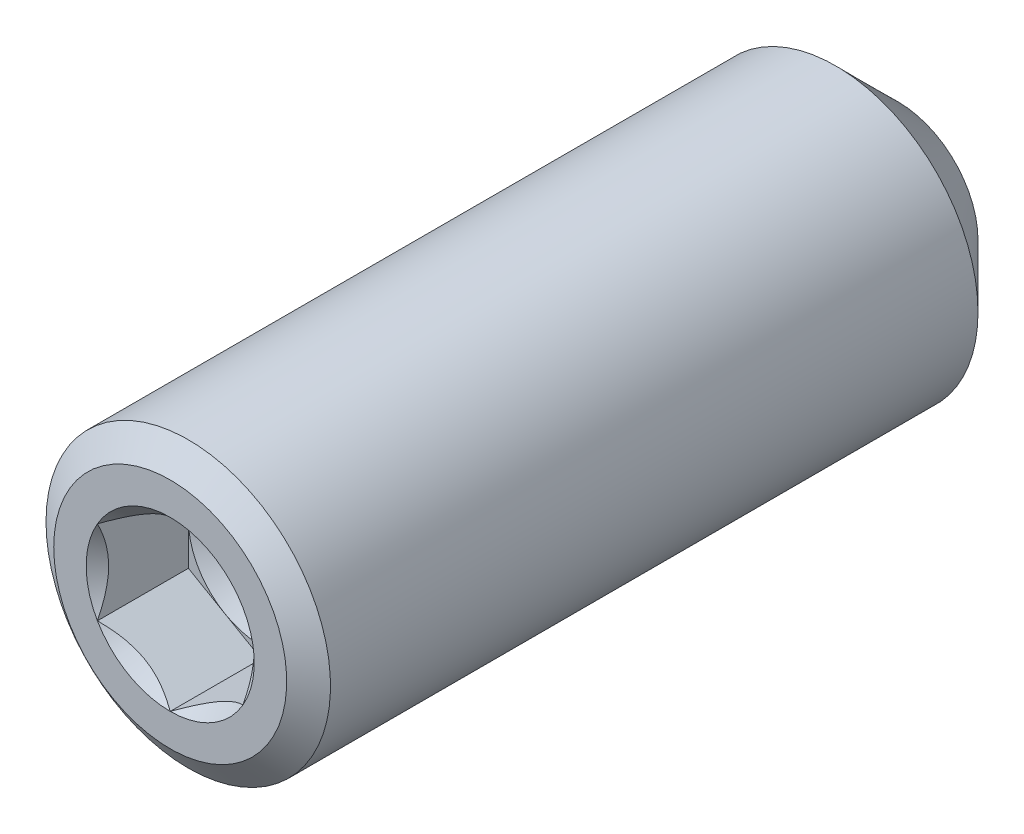
ISO-10303-21;
HEADER;
FILE_DESCRIPTION(('STEP AP214'),'2;1');
FILE_NAME('part.step','',(''),(''),'','','');
FILE_SCHEMA(('AUTOMOTIVE_DESIGN { 1 0 10303 214 1 1 1 1 }'));
ENDSEC;
DATA;
#1=APPLICATION_CONTEXT('core data for automotive mechanical design processes');
#2=APPLICATION_PROTOCOL_DEFINITION('international standard','automotive_design',2000,#1);
#3=PRODUCT_CONTEXT('',#1,'mechanical');
#4=PRODUCT('Part','Part','',(#3));
#5=PRODUCT_RELATED_PRODUCT_CATEGORY('part','',(#4));
#6=PRODUCT_DEFINITION_FORMATION('','',#4);
#7=PRODUCT_DEFINITION_CONTEXT('part definition',#1,'design');
#8=PRODUCT_DEFINITION('design','',#6,#7);
#9=PRODUCT_DEFINITION_SHAPE('','',#8);
#10=(LENGTH_UNIT() NAMED_UNIT(*) SI_UNIT(.MILLI.,.METRE.));
#11=(NAMED_UNIT(*) PLANE_ANGLE_UNIT() SI_UNIT($,.RADIAN.));
#12=(NAMED_UNIT(*) SI_UNIT($,.STERADIAN.) SOLID_ANGLE_UNIT());
#13=UNCERTAINTY_MEASURE_WITH_UNIT(LENGTH_MEASURE(1.E-05),#10,'distance_accuracy_value','');
#14=(GEOMETRIC_REPRESENTATION_CONTEXT(3) GLOBAL_UNCERTAINTY_ASSIGNED_CONTEXT((#13)) GLOBAL_UNIT_ASSIGNED_CONTEXT((#10,
#11,#12)) REPRESENTATION_CONTEXT('',''));
#15=CARTESIAN_POINT('',(0.,0.,0.));
#16=DIRECTION('',(0.,0.,1.));
#17=DIRECTION('',(1.,0.,0.));
#18=AXIS2_PLACEMENT_3D('',#15,#16,#17);
#19=CARTESIAN_POINT('',(0.,0.,-1.26725694678953));
#20=DIRECTION('',(0.,0.,1.));
#21=DIRECTION('',(1.,0.,0.));
#22=AXIS2_PLACEMENT_3D('',#19,#20,#21);
#23=CONICAL_SURFACE('',#22,0.99999999991951,1.04719755099412);
#24=CARTESIAN_POINT('',(0.,0.,-1.26725694672389));
#25=DIRECTION('',(0.,0.,1.));
#26=DIRECTION('',(1.,0.,0.));
#27=AXIS2_PLACEMENT_3D('',#24,#25,#26);
#28=CIRCLE('',#27,1.0000000000332);
#29=CARTESIAN_POINT('',(-0.999999999996476,0.,-1.26725694674409));
#30=VERTEX_POINT('',#29);
#31=CARTESIAN_POINT('',(-0.500000000008299,0.866025403798809,-1.26725694673147));
#32=VERTEX_POINT('',#31);
#33=EDGE_CURVE('E92',#30,#32,#28,.F.);
#34=ORIENTED_EDGE('',*,*,#33,.F.);
#35=CARTESIAN_POINT('',(0.,0.,-1.26725694672389));
#36=DIRECTION('',(0.,0.,1.));
#37=DIRECTION('',(1.,0.,0.));
#38=AXIS2_PLACEMENT_3D('',#35,#36,#37);
#39=CIRCLE('',#38,1.0000000000332);
#40=CARTESIAN_POINT('',(-0.5000000000083,-0.866025403798818,-1.26725694673147));
#41=VERTEX_POINT('',#40);
#42=EDGE_CURVE('E19',#41,#30,#39,.F.);
#43=ORIENTED_EDGE('',*,*,#42,.F.);
#44=CARTESIAN_POINT('',(0.,0.,-1.26725694672389));
#45=DIRECTION('',(0.,0.,1.));
#46=DIRECTION('',(1.,0.,0.));
#47=AXIS2_PLACEMENT_3D('',#44,#45,#46);
#48=CIRCLE('',#47,1.0000000000332);
#49=CARTESIAN_POINT('',(0.500000000008299,-0.866025403798819,-1.26725694673147));
#50=VERTEX_POINT('',#49);
#51=EDGE_CURVE('E89',#50,#41,#48,.F.);
#52=ORIENTED_EDGE('',*,*,#51,.F.);
#53=CARTESIAN_POINT('',(0.,0.,-1.26725694672389));
#54=DIRECTION('',(0.,0.,1.));
#55=DIRECTION('',(1.,0.,0.));
#56=AXIS2_PLACEMENT_3D('',#53,#54,#55);
#57=CIRCLE('',#56,1.0000000000332);
#58=CARTESIAN_POINT('',(1.0000000000166,0.,-1.26725694673147));
#59=VERTEX_POINT('',#58);
#60=EDGE_CURVE('E112',#59,#50,#57,.F.);
#61=ORIENTED_EDGE('',*,*,#60,.F.);
#62=CARTESIAN_POINT('',(0.,0.,-1.26725694672389));
#63=DIRECTION('',(0.,0.,1.));
#64=DIRECTION('',(1.,0.,0.));
#65=AXIS2_PLACEMENT_3D('',#62,#63,#64);
#66=CIRCLE('',#65,1.0000000000332);
#67=CARTESIAN_POINT('',(0.500000000008299,0.866025403798809,-1.26725694673147));
#68=VERTEX_POINT('',#67);
#69=EDGE_CURVE('E346',#68,#59,#66,.F.);
#70=ORIENTED_EDGE('',*,*,#69,.F.);
#71=CARTESIAN_POINT('',(0.,0.,-1.26725694672389));
#72=DIRECTION('',(0.,0.,1.));
#73=DIRECTION('',(1.,0.,0.));
#74=AXIS2_PLACEMENT_3D('',#71,#72,#73);
#75=CIRCLE('',#74,1.0000000000332);
#76=EDGE_CURVE('E350',#32,#68,#75,.F.);
#77=ORIENTED_EDGE('',*,*,#76,.F.);
#78=EDGE_LOOP('',(#34,#43,#52,#61,#70,#77));
#79=FACE_BOUND('',#78,.T.);
#80=CARTESIAN_POINT('',(2.27373675443232E-10,0.,-1.84460721607138));
#81=VERTEX_POINT('',#80);
#82=VERTEX_LOOP('',#81);
#83=FACE_BOUND('',#82,.T.);
#84=ADVANCED_FACE('F16',(#79,#83),#23,.F.);
#85=CARTESIAN_POINT('',(-1.,1.73205080756887,-1.26725694673904));
#86=DIRECTION('',(0.,0.,1.));
#87=DIRECTION('',(1.,0.,0.));
#88=AXIS2_PLACEMENT_3D('',#85,#86,#87);
#89=PLANE('',#88);
#90=DIRECTION('',(0.,-1.,0.));
#91=VECTOR('',#90,1.);
#92=CARTESIAN_POINT('',(-1.,0.577350269189621,-1.26725694673904));
#93=LINE('',#92,#91);
#94=CARTESIAN_POINT('',(-0.99999999999996,-0.577350269189666,-1.26725694673904));
#95=VERTEX_POINT('',#94);
#96=EDGE_CURVE('E99',#30,#95,#93,.T.);
#97=ORIENTED_EDGE('',*,*,#96,.T.);
#98=DIRECTION('',(0.866025403784439,-0.5,0.));
#99=VECTOR('',#98,1.);
#100=CARTESIAN_POINT('',(-1.,-0.577350269189631,-1.26725694673904));
#101=LINE('',#100,#99);
#102=EDGE_CURVE('E97',#95,#41,#101,.T.);
#103=ORIENTED_EDGE('',*,*,#102,.T.);
#104=ORIENTED_EDGE('',*,*,#42,.T.);
#105=EDGE_LOOP('',(#97,#103,#104));
#106=FACE_BOUND('',#105,.T.);
#107=ADVANCED_FACE('F98',(#106),#89,.T.);
#108=CARTESIAN_POINT('',(-1.,1.73205080756887,-1.26725694673904));
#109=DIRECTION('',(0.,0.,1.));
#110=DIRECTION('',(1.,0.,0.));
#111=AXIS2_PLACEMENT_3D('',#108,#109,#110);
#112=PLANE('',#111);
#113=DIRECTION('',(0.866025403784439,-0.5,0.));
#114=VECTOR('',#113,1.);
#115=CARTESIAN_POINT('',(-1.,-0.577350269189631,-1.26725694673904));
#116=LINE('',#115,#114);
#117=CARTESIAN_POINT('',(0.,-1.15470053837924,-1.26725694673904));
#118=VERTEX_POINT('',#117);
#119=EDGE_CURVE('E104',#41,#118,#116,.T.);
#120=ORIENTED_EDGE('',*,*,#119,.T.);
#121=DIRECTION('',(0.866025403784439,0.5,0.));
#122=VECTOR('',#121,1.);
#123=CARTESIAN_POINT('',(0.,-1.15470053837926,-1.26725694673904));
#124=LINE('',#123,#122);
#125=EDGE_CURVE('E110',#118,#50,#124,.T.);
#126=ORIENTED_EDGE('',*,*,#125,.T.);
#127=ORIENTED_EDGE('',*,*,#51,.T.);
#128=EDGE_LOOP('',(#120,#126,#127));
#129=FACE_BOUND('',#128,.T.);
#130=ADVANCED_FACE('F107',(#129),#112,.T.);
#131=CARTESIAN_POINT('',(-1.,1.73205080756887,-1.26725694673904));
#132=DIRECTION('',(0.,0.,1.));
#133=DIRECTION('',(1.,0.,0.));
#134=AXIS2_PLACEMENT_3D('',#131,#132,#133);
#135=PLANE('',#134);
#136=DIRECTION('',(0.866025403784439,0.5,0.));
#137=VECTOR('',#136,1.);
#138=CARTESIAN_POINT('',(0.,-1.15470053837926,-1.26725694673904));
#139=LINE('',#138,#137);
#140=CARTESIAN_POINT('',(1.00000000000001,-0.577350269189578,-1.26725694673904));
#141=VERTEX_POINT('',#140);
#142=EDGE_CURVE('E126',#50,#141,#139,.T.);
#143=ORIENTED_EDGE('',*,*,#142,.T.);
#144=DIRECTION('',(0.,1.,0.));
#145=VECTOR('',#144,1.);
#146=CARTESIAN_POINT('',(1.,-0.577350269189631,-1.26725694673904));
#147=LINE('',#146,#145);
#148=EDGE_CURVE('E310',#141,#59,#147,.T.);
#149=ORIENTED_EDGE('',*,*,#148,.T.);
#150=ORIENTED_EDGE('',*,*,#60,.T.);
#151=EDGE_LOOP('',(#143,#149,#150));
#152=FACE_BOUND('',#151,.T.);
#153=ADVANCED_FACE('F341',(#152),#135,.T.);
#154=CARTESIAN_POINT('',(-1.,1.73205080756887,-1.26725694673904));
#155=DIRECTION('',(0.,0.,1.));
#156=DIRECTION('',(1.,0.,0.));
#157=AXIS2_PLACEMENT_3D('',#154,#155,#156);
#158=PLANE('',#157);
#159=DIRECTION('',(0.,1.,0.));
#160=VECTOR('',#159,1.);
#161=CARTESIAN_POINT('',(1.,-0.577350269189631,-1.26725694673904));
#162=LINE('',#161,#160);
#163=CARTESIAN_POINT('',(0.999999999999972,0.577350269189646,-1.26725694673904));
#164=VERTEX_POINT('',#163);
#165=EDGE_CURVE('E306',#59,#164,#162,.T.);
#166=ORIENTED_EDGE('',*,*,#165,.T.);
#167=DIRECTION('',(-0.866025403784439,0.5,0.));
#168=VECTOR('',#167,1.);
#169=CARTESIAN_POINT('',(1.,0.577350269189621,-1.26725694673904));
#170=LINE('',#169,#168);
#171=EDGE_CURVE('E305',#164,#68,#170,.T.);
#172=ORIENTED_EDGE('',*,*,#171,.T.);
#173=ORIENTED_EDGE('',*,*,#69,.T.);
#174=EDGE_LOOP('',(#166,#172,#173));
#175=FACE_BOUND('',#174,.T.);
#176=ADVANCED_FACE('F347',(#175),#158,.T.);
#177=CARTESIAN_POINT('',(-1.,1.73205080756887,-1.26725694673904));
#178=DIRECTION('',(0.,0.,1.));
#179=DIRECTION('',(1.,0.,0.));
#180=AXIS2_PLACEMENT_3D('',#177,#178,#179);
#181=PLANE('',#180);
#182=DIRECTION('',(-0.866025403784439,0.5,0.));
#183=VECTOR('',#182,1.);
#184=CARTESIAN_POINT('',(1.,0.577350269189621,-1.26725694673904));
#185=LINE('',#184,#183);
#186=CARTESIAN_POINT('',(0.,1.15470053837925,-1.26725694673904));
#187=VERTEX_POINT('',#186);
#188=EDGE_CURVE('E299',#68,#187,#185,.T.);
#189=ORIENTED_EDGE('',*,*,#188,.T.);
#190=DIRECTION('',(-0.866025403784439,-0.5,0.));
#191=VECTOR('',#190,1.);
#192=CARTESIAN_POINT('',(0.,1.15470053837925,-1.26725694673904));
#193=LINE('',#192,#191);
#194=EDGE_CURVE('E298',#187,#32,#193,.T.);
#195=ORIENTED_EDGE('',*,*,#194,.T.);
#196=ORIENTED_EDGE('',*,*,#76,.T.);
#197=EDGE_LOOP('',(#189,#195,#196));
#198=FACE_BOUND('',#197,.T.);
#199=ADVANCED_FACE('F359',(#198),#181,.T.);
#200=CARTESIAN_POINT('',(-1.,1.73205080756887,-1.26725694673904));
#201=DIRECTION('',(0.,0.,1.));
#202=DIRECTION('',(1.,0.,0.));
#203=AXIS2_PLACEMENT_3D('',#200,#201,#202);
#204=PLANE('',#203);
#205=DIRECTION('',(-0.866025403784439,-0.5,0.));
#206=VECTOR('',#205,1.);
#207=CARTESIAN_POINT('',(0.,1.15470053837925,-1.26725694673904));
#208=LINE('',#207,#206);
#209=CARTESIAN_POINT('',(-1.,0.577350269189622,-1.26725694673904));
#210=VERTEX_POINT('',#209);
#211=EDGE_CURVE('E292',#32,#210,#208,.T.);
#212=ORIENTED_EDGE('',*,*,#211,.T.);
#213=DIRECTION('',(0.,-1.,0.));
#214=VECTOR('',#213,1.);
#215=CARTESIAN_POINT('',(-1.,0.577350269189621,-1.26725694673904));
#216=LINE('',#215,#214);
#217=EDGE_CURVE('E130',#210,#30,#216,.T.);
#218=ORIENTED_EDGE('',*,*,#217,.T.);
#219=ORIENTED_EDGE('',*,*,#33,.T.);
#220=EDGE_LOOP('',(#212,#218,#219));
#221=FACE_BOUND('',#220,.T.);
#222=ADVANCED_FACE('F364',(#221),#204,.T.);
#223=CARTESIAN_POINT('',(-1.,0.577350269189621,-1.26725694673904));
#224=DIRECTION('',(-1.,0.,0.));
#225=DIRECTION('',(0.,-1.,0.));
#226=AXIS2_PLACEMENT_3D('',#223,#224,#225);
#227=PLANE('',#226);
#228=CARTESIAN_POINT('',(-0.999999999995421,0.577350269201763,-0.0172569467675729));
#229=CARTESIAN_POINT('',(-0.999999999998353,0.53766259330573,-0.0370816470854354));
#230=CARTESIAN_POINT('',(-0.999999999999558,0.497311421197551,-0.0557419131490855));
#231=CARTESIAN_POINT('',(-1.00000000000045,0.41503123975332,-0.089908069903511));
#232=CARTESIAN_POINT('',(-1.00000000000012,0.373094409840016,-0.105394956807298));
#233=CARTESIAN_POINT('',(-0.999999999999884,0.288530684286817,-0.131923906455443));
#234=CARTESIAN_POINT('',(-0.99999999999997,0.2459253154492,-0.143032634244833));
#235=CARTESIAN_POINT('',(-1.00000000000003,0.159777529607276,-0.160148459916529));
#236=CARTESIAN_POINT('',(-1.00000000000001,0.116237740789767,-0.166168326994063));
#237=CARTESIAN_POINT('',(-0.999999999999995,0.041190805636566,-0.171598062088634));
#238=CARTESIAN_POINT('',(-0.999999999999999,0.00978111645860827,-0.172400379920507));
#239=CARTESIAN_POINT('',(-1.,-0.0529773241572559,-0.171048167113774));
#240=CARTESIAN_POINT('',(-1.,-0.0843260606025248,-0.168892983315698));
#241=CARTESIAN_POINT('',(-1.,-0.177924373817535,-0.15813362719194));
#242=CARTESIAN_POINT('',(-1.,-0.239708022653016,-0.145234438698292));
#243=CARTESIAN_POINT('',(-1.,-0.34809918718393,-0.114119266303241));
#244=CARTESIAN_POINT('',(-1.,-0.395216894793119,-0.0975399591567761));
#245=CARTESIAN_POINT('',(-1.,-0.487608327503127,-0.0601956618666922));
#246=CARTESIAN_POINT('',(-1.,-0.532887492946774,-0.0394442971598875));
#247=CARTESIAN_POINT('',(-1.,-0.577350269202541,-0.0172569467697208));
#248=B_SPLINE_CURVE_WITH_KNOTS('',3,(#228,#229,#230,#231,#232,#233,#234,#235,#236,#237,#238,
#239,#240,#241,#242,#243,#244,#245,#246,#247),.UNSPECIFIED.,.F.,.F.,(4,2,2,2,2,2,2,2,2,4),(0.,
0.133182946550927,0.267141541406727,0.398973326726491,0.530473323585895,0.624596460286415,
0.718740387275724,0.90708160029007,1.05673041318259,1.20589820630046),.UNSPECIFIED.);
#249=CARTESIAN_POINT('',(-1.00000000000574,0.577350269192881,-0.0172569467695536));
#250=VERTEX_POINT('',#249);
#251=CARTESIAN_POINT('',(-1.00000000001206,-0.577350269189309,-0.0172569467658887));
#252=VERTEX_POINT('',#251);
#253=EDGE_CURVE('E234',#250,#252,#248,.T.);
#254=ORIENTED_EDGE('',*,*,#253,.T.);
#255=DIRECTION('',(0.,0.,1.));
#256=VECTOR('',#255,1.);
#257=CARTESIAN_POINT('',(-0.99999999999994,-0.577350269189666,-1.26725694673904));
#258=LINE('',#257,#256);
#259=EDGE_CURVE('E116',#252,#95,#258,.F.);
#260=ORIENTED_EDGE('',*,*,#259,.T.);
#261=ORIENTED_EDGE('',*,*,#96,.F.);
#262=ORIENTED_EDGE('',*,*,#217,.F.);
#263=DIRECTION('',(0.,0.,1.));
#264=VECTOR('',#263,1.);
#265=CARTESIAN_POINT('',(-1.,0.577350269189621,-1.26725694673904));
#266=LINE('',#265,#264);
#267=EDGE_CURVE('E288',#210,#250,#266,.T.);
#268=ORIENTED_EDGE('',*,*,#267,.T.);
#269=EDGE_LOOP('',(#254,#260,#261,#262,#268));
#270=FACE_BOUND('',#269,.T.);
#271=ADVANCED_FACE('F225',(#270),#227,.F.);
#272=CARTESIAN_POINT('',(-1.,-0.577350269189631,-1.26725694673904));
#273=DIRECTION('',(-0.5,-0.866025403784439,0.));
#274=DIRECTION('',(0.866025403784439,-0.5,0.));
#275=AXIS2_PLACEMENT_3D('',#272,#273,#274);
#276=PLANE('',#275);
#277=CARTESIAN_POINT('',(-1.00000000000822,-0.577350269179602,-0.0172569467676005));
#278=CARTESIAN_POINT('',(-0.965629464466558,-0.597194107130155,-0.0370816470854609));
#279=CARTESIAN_POINT('',(-0.930684324349,-0.617369693185287,-0.0557419131491097));
#280=CARTESIAN_POINT('',(-0.859427596990747,-0.658509783908169,-0.0899080699035332));
#281=CARTESIAN_POINT('',(-0.823109236931477,-0.679478198864538,-0.10539495680732));
#282=CARTESIAN_POINT('',(-0.749874902363636,-0.721760061640934,-0.131923906455464));
#283=CARTESIAN_POINT('',(-0.712977570612697,-0.743062746059815,-0.143032634244853));
#284=CARTESIAN_POINT('',(-0.638371399593842,-0.78613663898083,-0.160148459916548));
#285=CARTESIAN_POINT('',(-0.600664836402459,-0.807906533389563,-0.166168326994081));
#286=CARTESIAN_POINT('',(-0.535672284083619,-0.845430000966153,-0.171598062088652));
#287=CARTESIAN_POINT('',(-0.508470695330536,-0.861134845555134,-0.172400379920525));
#288=CARTESIAN_POINT('',(-0.454120291455303,-0.892514065863068,-0.171048167113792));
#289=CARTESIAN_POINT('',(-0.426971489317157,-0.908188434085702,-0.168892983315715));
#290=CARTESIAN_POINT('',(-0.345912972321585,-0.954987590693205,-0.158133627191956));
#291=CARTESIAN_POINT('',(-0.292406762891563,-0.985879415110946,-0.145234438698309));
#292=CARTESIAN_POINT('',(-0.198537260862009,-1.04007499737641,-0.114119266303255));
#293=CARTESIAN_POINT('',(-0.15773212910436,-1.063633851181,-0.0975399591567885));
#294=CARTESIAN_POINT('',(-0.0777188012854456,-1.10982956753601,-0.0601956618666998));
#295=CARTESIAN_POINT('',(-0.0385058937490852,-1.13246915025784,-0.0394442971598923));
#296=CARTESIAN_POINT('',(1.11958770631531E-11,-1.15470053838572,-0.0172569467697223));
#297=B_SPLINE_CURVE_WITH_KNOTS('',3,(#277,#278,#279,#280,#281,#282,#283,#284,#285,#286,#287,
#288,#289,#290,#291,#292,#293,#294,#295,#296),.UNSPECIFIED.,.F.,.F.,(4,2,2,2,2,2,2,2,2,4),(0.,
0.133182946550923,0.26714154140672,0.398973326726481,0.530473323585881,0.624596460286401,
0.718740387275708,0.907081600290052,1.05673041318258,1.20589820630047),.UNSPECIFIED.);
#298=CARTESIAN_POINT('',(-6.31169427938226E-12,-1.15470053838955,-0.0172569467658894));
#299=VERTEX_POINT('',#298);
#300=EDGE_CURVE('E228',#252,#299,#297,.T.);
#301=ORIENTED_EDGE('',*,*,#300,.T.);
#302=DIRECTION('',(0.,0.,1.));
#303=VECTOR('',#302,1.);
#304=CARTESIAN_POINT('',(0.,-1.15470053837922,-1.26725694673904));
#305=LINE('',#304,#303);
#306=EDGE_CURVE('E115',#299,#118,#305,.F.);
#307=ORIENTED_EDGE('',*,*,#306,.T.);
#308=ORIENTED_EDGE('',*,*,#119,.F.);
#309=ORIENTED_EDGE('',*,*,#102,.F.);
#310=ORIENTED_EDGE('',*,*,#259,.F.);
#311=EDGE_LOOP('',(#301,#307,#308,#309,#310));
#312=FACE_BOUND('',#311,.T.);
#313=ADVANCED_FACE('F113',(#312),#276,.F.);
#314=CARTESIAN_POINT('',(0.,-1.15470053837926,-1.26725694673904));
#315=DIRECTION('',(0.5,-0.866025403784439,0.));
#316=DIRECTION('',(0.866025403784439,0.5,0.));
#317=AXIS2_PLACEMENT_3D('',#314,#315,#316);
#318=PLANE('',#317);
#319=CARTESIAN_POINT('',(-1.27907551351768E-11,-1.15470053838137,-0.0172569467676159));
#320=CARTESIAN_POINT('',(0.0343705355317997,-1.13485670043588,-0.0370816470854732));
#321=CARTESIAN_POINT('',(0.0693156756505605,-1.11468111438284,-0.05574191314912));
#322=CARTESIAN_POINT('',(0.140572403009697,-1.07354102366149,-0.0899080699035407));
#323=CARTESIAN_POINT('',(0.176890763068639,-1.05257260870456,-0.105394956807327));
#324=CARTESIAN_POINT('',(0.250125097636244,-1.01029074592776,-0.131923906455468));
#325=CARTESIAN_POINT('',(0.287022429387266,-0.988988061509023,-0.143032634244856));
#326=CARTESIAN_POINT('',(0.36162860040618,-0.945914168588117,-0.160148459916549));
#327=CARTESIAN_POINT('',(0.399335163597539,-0.924144274179343,-0.166168326994082));
#328=CARTESIAN_POINT('',(0.464327715916365,-0.886620806602734,-0.171598062088652));
#329=CARTESIAN_POINT('',(0.491529304669451,-0.870915962013758,-0.172400379920525));
#330=CARTESIAN_POINT('',(0.545879708544687,-0.839536741705829,-0.171048167113791));
#331=CARTESIAN_POINT('',(0.573028510682833,-0.823862373483194,-0.168892983315715));
#332=CARTESIAN_POINT('',(0.654087027678403,-0.777063216875688,-0.158133627191955));
#333=CARTESIAN_POINT('',(0.707593237108426,-0.746171392457949,-0.145234438698307));
#334=CARTESIAN_POINT('',(0.801462739137979,-0.691975810192491,-0.114119266303253));
#335=CARTESIAN_POINT('',(0.842267870895627,-0.668416956387894,-0.097539959156786));
#336=CARTESIAN_POINT('',(0.922281198714541,-0.622221240032886,-0.0601956618666972));
#337=CARTESIAN_POINT('',(0.961494106250901,-0.599581657311061,-0.0394442971598899));
#338=CARTESIAN_POINT('',(1.00000000001118,-0.577350269183176,-0.0172569467697204));
#339=B_SPLINE_CURVE_WITH_KNOTS('',3,(#319,#320,#321,#322,#323,#324,#325,#326,#327,#328,#329,
#330,#331,#332,#333,#334,#335,#336,#337,#338),.UNSPECIFIED.,.F.,.F.,(4,2,2,2,2,2,2,2,2,4),(0.,
0.133182946550918,0.26714154140671,0.398973326726465,0.53047332358586,0.62459646028638,
0.718740387275687,0.907081600290032,1.05673041318256,1.20589820630044),.UNSPECIFIED.);
#340=CARTESIAN_POINT('',(1.00000000000575,-0.57735026920024,-0.0172569467658884));
#341=VERTEX_POINT('',#340);
#342=EDGE_CURVE('E204',#299,#341,#339,.T.);
#343=ORIENTED_EDGE('',*,*,#342,.T.);
#344=DIRECTION('',(0.,0.,-1.));
#345=VECTOR('',#344,1.);
#346=CARTESIAN_POINT('',(1.,-0.57735026918956,-1.26725694673904));
#347=LINE('',#346,#345);
#348=EDGE_CURVE('E302',#341,#141,#347,.T.);
#349=ORIENTED_EDGE('',*,*,#348,.T.);
#350=ORIENTED_EDGE('',*,*,#142,.F.);
#351=ORIENTED_EDGE('',*,*,#125,.F.);
#352=ORIENTED_EDGE('',*,*,#306,.F.);
#353=EDGE_LOOP('',(#343,#349,#350,#351,#352));
#354=FACE_BOUND('',#353,.T.);
#355=ADVANCED_FACE('F215',(#354),#318,.F.);
#356=CARTESIAN_POINT('',(1.,-0.577350269189631,-1.26725694673904));
#357=DIRECTION('',(1.,0.,0.));
#358=DIRECTION('',(0.,0.,-1.));
#359=AXIS2_PLACEMENT_3D('',#356,#357,#358);
#360=PLANE('',#359);
#361=CARTESIAN_POINT('',(0.999999999995426,-0.577350269201765,-0.0172569467676012));
#362=CARTESIAN_POINT('',(0.999999999998354,-0.537662593305733,-0.0370816470854594));
#363=CARTESIAN_POINT('',(0.999999999999559,-0.497311421197557,-0.0557419131491062));
#364=CARTESIAN_POINT('',(1.00000000000044,-0.415031239753332,-0.089908069903526));
#365=CARTESIAN_POINT('',(1.00000000000012,-0.373094409840032,-0.105394956807311));
#366=CARTESIAN_POINT('',(0.999999999999884,-0.28853068428684,-0.131923906455452));
#367=CARTESIAN_POINT('',(0.99999999999997,-0.245925315449226,-0.143032634244839));
#368=CARTESIAN_POINT('',(1.00000000000003,-0.15977752960731,-0.160148459916532));
#369=CARTESIAN_POINT('',(1.00000000000001,-0.116237740789804,-0.166168326994064));
#370=CARTESIAN_POINT('',(0.999999999999995,-0.041190805636607,-0.171598062088634));
#371=CARTESIAN_POINT('',(0.999999999999999,-0.00978111645864932,-0.172400379920508));
#372=CARTESIAN_POINT('',(1.,0.0529773241572145,-0.171048167113774));
#373=CARTESIAN_POINT('',(1.,0.0843260606024832,-0.168892983315697));
#374=CARTESIAN_POINT('',(1.,0.177924373817493,-0.158133627191938));
#375=CARTESIAN_POINT('',(1.,0.239708022652974,-0.14523443869829));
#376=CARTESIAN_POINT('',(1.,0.348099187183887,-0.114119266303238));
#377=CARTESIAN_POINT('',(1.,0.395216894793075,-0.0975399591567731));
#378=CARTESIAN_POINT('',(1.,0.487608327503082,-0.0601956618666891));
#379=CARTESIAN_POINT('',(1.,0.532887492946728,-0.0394442971598843));
#380=CARTESIAN_POINT('',(1.,0.577350269202495,-0.0172569467697173));
#381=B_SPLINE_CURVE_WITH_KNOTS('',3,(#361,#362,#363,#364,#365,#366,#367,#368,#369,#370,#371,
#372,#373,#374,#375,#376,#377,#378,#379,#380),.UNSPECIFIED.,.F.,.F.,(4,2,2,2,2,2,2,2,2,4),(0.,
0.133182946550915,0.267141541406703,0.398973326726456,0.530473323585848,0.624596460286368,
0.718740387275676,0.907081600290022,1.05673041318254,1.20589820630041),.UNSPECIFIED.);
#382=CARTESIAN_POINT('',(1.00000000001205,0.577350269189292,-0.0172569467658871));
#383=VERTEX_POINT('',#382);
#384=EDGE_CURVE('E197',#341,#383,#381,.T.);
#385=ORIENTED_EDGE('',*,*,#384,.T.);
#386=DIRECTION('',(0.,0.,1.));
#387=VECTOR('',#386,1.);
#388=CARTESIAN_POINT('',(0.999999999999957,0.577350269189646,-1.26725694673904));
#389=LINE('',#388,#387);
#390=EDGE_CURVE('E295',#383,#164,#389,.F.);
#391=ORIENTED_EDGE('',*,*,#390,.T.);
#392=ORIENTED_EDGE('',*,*,#165,.F.);
#393=ORIENTED_EDGE('',*,*,#148,.F.);
#394=ORIENTED_EDGE('',*,*,#348,.F.);
#395=EDGE_LOOP('',(#385,#391,#392,#393,#394));
#396=FACE_BOUND('',#395,.T.);
#397=ADVANCED_FACE('F211',(#396),#360,.F.);
#398=CARTESIAN_POINT('',(1.,0.577350269189621,-1.26725694673904));
#399=DIRECTION('',(0.5,0.866025403784439,0.));
#400=DIRECTION('',(-0.866025403784439,0.5,0.));
#401=AXIS2_PLACEMENT_3D('',#398,#399,#400);
#402=PLANE('',#401);
#403=CARTESIAN_POINT('',(1.00000000000822,0.57735026917958,-0.0172569467675707));
#404=CARTESIAN_POINT('',(0.965629464466563,0.597194107130138,-0.0370816470854328));
#405=CARTESIAN_POINT('',(0.930684324349007,0.617369693185271,-0.0557419131490814));
#406=CARTESIAN_POINT('',(0.859427596990758,0.658509783908154,-0.0899080699035033));
#407=CARTESIAN_POINT('',(0.823109236931489,0.679478198864521,-0.105394956807288));
#408=CARTESIAN_POINT('',(0.74987490236365,0.721760061640915,-0.13192390645543));
#409=CARTESIAN_POINT('',(0.712977570612713,0.743062746059796,-0.143032634244818));
#410=CARTESIAN_POINT('',(0.63837139959386,0.786136638980809,-0.160148459916511));
#411=CARTESIAN_POINT('',(0.600664836402478,0.807906533389542,-0.166168326994044));
#412=CARTESIAN_POINT('',(0.535672284083638,0.845430000966131,-0.171598062088615));
#413=CARTESIAN_POINT('',(0.508470695330555,0.861134845555113,-0.172400379920488));
#414=CARTESIAN_POINT('',(0.45412029145532,0.892514065863048,-0.171048167113755));
#415=CARTESIAN_POINT('',(0.426971489317173,0.908188434085682,-0.168892983315678));
#416=CARTESIAN_POINT('',(0.345912972321599,0.954987590693187,-0.158133627191919));
#417=CARTESIAN_POINT('',(0.292406762891575,0.985879415110929,-0.145234438698271));
#418=CARTESIAN_POINT('',(0.198537260862037,1.04007499737638,-0.114119266303223));
#419=CARTESIAN_POINT('',(0.157732129104403,1.06363385118097,-0.0975399591567643));
#420=CARTESIAN_POINT('',(0.0777188012855182,1.10982956753596,-0.0601956618666939));
#421=CARTESIAN_POINT('',(0.0385058937491723,1.13246915025777,-0.039444297159897));
#422=CARTESIAN_POINT('',(-1.10948717346902E-11,1.15470053838565,-0.0172569467697383));
#423=B_SPLINE_CURVE_WITH_KNOTS('',3,(#403,#404,#405,#406,#407,#408,#409,#410,#411,#412,#413,
#414,#415,#416,#417,#418,#419,#420,#421,#422),.UNSPECIFIED.,.F.,.F.,(4,2,2,2,2,2,2,2,2,4),(0.,
0.133182946550918,0.26714154140671,0.398973326726466,0.530473323585862,0.624596460286384,
0.718740387275694,0.907081600290043,1.05673041318252,1.20589820630034),.UNSPECIFIED.);
#424=CARTESIAN_POINT('',(6.32595022348094E-12,1.15470053838949,-0.0172569467658978));
#425=VERTEX_POINT('',#424);
#426=EDGE_CURVE('E166',#383,#425,#423,.T.);
#427=ORIENTED_EDGE('',*,*,#426,.T.);
#428=DIRECTION('',(0.,0.,1.));
#429=VECTOR('',#428,1.);
#430=CARTESIAN_POINT('',(0.,1.15470053837925,-1.26725694673904));
#431=LINE('',#430,#429);
#432=EDGE_CURVE('E285',#425,#187,#431,.F.);
#433=ORIENTED_EDGE('',*,*,#432,.T.);
#434=ORIENTED_EDGE('',*,*,#188,.F.);
#435=ORIENTED_EDGE('',*,*,#171,.F.);
#436=ORIENTED_EDGE('',*,*,#390,.F.);
#437=EDGE_LOOP('',(#427,#433,#434,#435,#436));
#438=FACE_BOUND('',#437,.T.);
#439=ADVANCED_FACE('F214',(#438),#402,.F.);
#440=CARTESIAN_POINT('',(0.,1.15470053837925,-1.26725694673904));
#441=DIRECTION('',(-0.5,0.866025403784439,0.));
#442=DIRECTION('',(-0.866025403784439,-0.5,0.));
#443=AXIS2_PLACEMENT_3D('',#440,#441,#442);
#444=PLANE('',#443);
#445=CARTESIAN_POINT('',(1.28513580720746E-11,1.15470053838134,-0.0172569467675267));
#446=CARTESIAN_POINT('',(-0.0343705355317509,1.13485670043588,-0.0370816470853999));
#447=CARTESIAN_POINT('',(-0.0693156756505183,1.11468111438285,-0.0557419131490549));
#448=CARTESIAN_POINT('',(-0.140572403009663,1.0735410236615,-0.0899080699034851));
#449=CARTESIAN_POINT('',(-0.176890763068607,1.05257260870457,-0.105394956807272));
#450=CARTESIAN_POINT('',(-0.250125097636216,1.01029074592776,-0.131923906455418));
#451=CARTESIAN_POINT('',(-0.287022429387242,0.988988061509027,-0.143032634244808));
#452=CARTESIAN_POINT('',(-0.361628600406162,0.945914168588118,-0.160148459916506));
#453=CARTESIAN_POINT('',(-0.399335163597523,0.924144274179342,-0.166168326994041));
#454=CARTESIAN_POINT('',(-0.464327715916353,0.886620806602731,-0.171598062088613));
#455=CARTESIAN_POINT('',(-0.49152930466944,0.870915962013755,-0.172400379920488));
#456=CARTESIAN_POINT('',(-0.545879708544678,0.839536741705825,-0.171048167113756));
#457=CARTESIAN_POINT('',(-0.573028510682824,0.823862373483189,-0.16889298331568));
#458=CARTESIAN_POINT('',(-0.654087027678396,0.777063216875682,-0.158133627191924));
#459=CARTESIAN_POINT('',(-0.707593237108421,0.746171392457942,-0.145234438698277));
#460=CARTESIAN_POINT('',(-0.801462739137971,0.691975810192485,-0.114119266303228));
#461=CARTESIAN_POINT('',(-0.842267870895615,0.668416956387891,-0.0975399591567644));
#462=CARTESIAN_POINT('',(-0.922281198714521,0.622221240032888,-0.0601956618666833));
#463=CARTESIAN_POINT('',(-0.961494106250877,0.599581657311065,-0.0394442971598801));
#464=CARTESIAN_POINT('',(-1.00000000001115,0.577350269183182,-0.0172569467697145));
#465=B_SPLINE_CURVE_WITH_KNOTS('',3,(#445,#446,#447,#448,#449,#450,#451,#452,#453,#454,#455,
#456,#457,#458,#459,#460,#461,#462,#463,#464),.UNSPECIFIED.,.F.,.F.,(4,2,2,2,2,2,2,2,2,4),(0.,
0.13318294655093,0.267141541406734,0.3989733267265,0.530473323585906,0.624596460286428,
0.718740387275738,0.907081600290087,1.0567304131826,1.20589820630047),.UNSPECIFIED.);
#466=EDGE_CURVE('E157',#425,#250,#465,.T.);
#467=ORIENTED_EDGE('',*,*,#466,.T.);
#468=ORIENTED_EDGE('',*,*,#267,.F.);
#469=ORIENTED_EDGE('',*,*,#211,.F.);
#470=ORIENTED_EDGE('',*,*,#194,.F.);
#471=ORIENTED_EDGE('',*,*,#432,.F.);
#472=EDGE_LOOP('',(#467,#468,#469,#470,#471));
#473=FACE_BOUND('',#472,.T.);
#474=ADVANCED_FACE('F174',(#473),#444,.F.);
#475=CARTESIAN_POINT('',(0.,0.,-0.0172569467054018));
#476=DIRECTION('',(0.,0.,1.));
#477=DIRECTION('',(1.,0.,0.));
#478=AXIS2_PLACEMENT_3D('',#475,#476,#477);
#479=CONICAL_SURFACE('',#478,1.15470053845002,0.785398163214823);
#480=ORIENTED_EDGE('',*,*,#253,.F.);
#481=CARTESIAN_POINT('',(0.,0.,-0.0172569467622452));
#482=DIRECTION('',(0.,0.,1.));
#483=DIRECTION('',(1.,0.,0.));
#484=AXIS2_PLACEMENT_3D('',#481,#482,#483);
#485=CIRCLE('',#484,1.15470053839317);
#486=EDGE_CURVE('E154',#250,#252,#485,.T.);
#487=ORIENTED_EDGE('',*,*,#486,.T.);
#488=EDGE_LOOP('',(#480,#487));
#489=FACE_BOUND('',#488,.T.);
#490=ADVANCED_FACE('F243',(#489),#479,.F.);
#491=CARTESIAN_POINT('',(0.,0.,-0.0172569467054018));
#492=DIRECTION('',(0.,0.,1.));
#493=DIRECTION('',(1.,0.,0.));
#494=AXIS2_PLACEMENT_3D('',#491,#492,#493);
#495=CONICAL_SURFACE('',#494,1.15470053845002,0.785398163214826);
#496=ORIENTED_EDGE('',*,*,#300,.F.);
#497=CARTESIAN_POINT('',(0.,0.,-0.0172569467622452));
#498=DIRECTION('',(0.,0.,1.));
#499=DIRECTION('',(1.,0.,0.));
#500=AXIS2_PLACEMENT_3D('',#497,#498,#499);
#501=CIRCLE('',#500,1.15470053839317);
#502=EDGE_CURVE('E151',#252,#299,#501,.T.);
#503=ORIENTED_EDGE('',*,*,#502,.T.);
#504=EDGE_LOOP('',(#496,#503));
#505=FACE_BOUND('',#504,.T.);
#506=ADVANCED_FACE('F240',(#505),#495,.F.);
#507=CARTESIAN_POINT('',(0.,0.,-0.0172569467054018));
#508=DIRECTION('',(0.,0.,1.));
#509=DIRECTION('',(1.,0.,0.));
#510=AXIS2_PLACEMENT_3D('',#507,#508,#509);
#511=CONICAL_SURFACE('',#510,1.15470053845002,0.785398163214826);
#512=ORIENTED_EDGE('',*,*,#342,.F.);
#513=CARTESIAN_POINT('',(0.,0.,-0.0172569467622452));
#514=DIRECTION('',(0.,0.,1.));
#515=DIRECTION('',(1.,0.,0.));
#516=AXIS2_PLACEMENT_3D('',#513,#514,#515);
#517=CIRCLE('',#516,1.15470053839317);
#518=EDGE_CURVE('E148',#299,#341,#517,.T.);
#519=ORIENTED_EDGE('',*,*,#518,.T.);
#520=EDGE_LOOP('',(#512,#519));
#521=FACE_BOUND('',#520,.T.);
#522=ADVANCED_FACE('F193',(#521),#511,.F.);
#523=CARTESIAN_POINT('',(0.,0.,-0.0172569467054018));
#524=DIRECTION('',(0.,0.,1.));
#525=DIRECTION('',(1.,0.,0.));
#526=AXIS2_PLACEMENT_3D('',#523,#524,#525);
#527=CONICAL_SURFACE('',#526,1.15470053845002,0.785398163214823);
#528=CARTESIAN_POINT('',(0.,0.,-0.0172569467622452));
#529=DIRECTION('',(0.,0.,1.));
#530=DIRECTION('',(1.,0.,0.));
#531=AXIS2_PLACEMENT_3D('',#528,#529,#530);
#532=CIRCLE('',#531,1.15470053839317);
#533=EDGE_CURVE('E145',#341,#383,#532,.T.);
#534=ORIENTED_EDGE('',*,*,#533,.T.);
#535=ORIENTED_EDGE('',*,*,#384,.F.);
#536=EDGE_LOOP('',(#534,#535));
#537=FACE_BOUND('',#536,.T.);
#538=ADVANCED_FACE('F188',(#537),#527,.F.);
#539=CARTESIAN_POINT('',(0.,0.,-0.0172569467054018));
#540=DIRECTION('',(0.,0.,1.));
#541=DIRECTION('',(1.,0.,0.));
#542=AXIS2_PLACEMENT_3D('',#539,#540,#541);
#543=CONICAL_SURFACE('',#542,1.15470053845002,0.785398163214826);
#544=ORIENTED_EDGE('',*,*,#426,.F.);
#545=CARTESIAN_POINT('',(0.,0.,-0.0172569467622452));
#546=DIRECTION('',(0.,0.,1.));
#547=DIRECTION('',(1.,0.,0.));
#548=AXIS2_PLACEMENT_3D('',#545,#546,#547);
#549=CIRCLE('',#548,1.15470053839317);
#550=EDGE_CURVE('E142',#383,#425,#549,.T.);
#551=ORIENTED_EDGE('',*,*,#550,.T.);
#552=EDGE_LOOP('',(#544,#551));
#553=FACE_BOUND('',#552,.T.);
#554=ADVANCED_FACE('F182',(#553),#543,.F.);
#555=CARTESIAN_POINT('',(0.,0.,-0.0172569467054018));
#556=DIRECTION('',(0.,0.,1.));
#557=DIRECTION('',(1.,0.,0.));
#558=AXIS2_PLACEMENT_3D('',#555,#556,#557);
#559=CONICAL_SURFACE('',#558,1.15470053845002,0.785398163214826);
#560=ORIENTED_EDGE('',*,*,#466,.F.);
#561=CARTESIAN_POINT('',(0.,0.,-0.0172569467622452));
#562=DIRECTION('',(0.,0.,1.));
#563=DIRECTION('',(1.,0.,0.));
#564=AXIS2_PLACEMENT_3D('',#561,#562,#563);
#565=CIRCLE('',#564,1.15470053839317);
#566=EDGE_CURVE('E139',#425,#250,#565,.T.);
#567=ORIENTED_EDGE('',*,*,#566,.T.);
#568=EDGE_LOOP('',(#560,#567));
#569=FACE_BOUND('',#568,.T.);
#570=ADVANCED_FACE('F177',(#569),#559,.F.);
#571=CARTESIAN_POINT('',(0.,0.,-0.0172569467390376));
#572=DIRECTION('',(0.,0.,-1.));
#573=DIRECTION('',(0.,1.,0.));
#574=AXIS2_PLACEMENT_3D('',#571,#572,#573);
#575=PLANE('',#574);
#576=ORIENTED_EDGE('',*,*,#550,.F.);
#577=ORIENTED_EDGE('',*,*,#533,.F.);
#578=ORIENTED_EDGE('',*,*,#518,.F.);
#579=ORIENTED_EDGE('',*,*,#502,.F.);
#580=ORIENTED_EDGE('',*,*,#486,.F.);
#581=ORIENTED_EDGE('',*,*,#566,.F.);
#582=EDGE_LOOP('',(#576,#577,#578,#579,#580,#581));
#583=FACE_BOUND('',#582,.T.);
#584=CARTESIAN_POINT('',(0.,0.,-0.0172569467622452));
#585=DIRECTION('',(0.,0.,-1.));
#586=DIRECTION('',(-1.,0.,0.));
#587=AXIS2_PLACEMENT_3D('',#584,#585,#586);
#588=CIRCLE('',#587,1.59999999993943);
#589=CARTESIAN_POINT('',(-1.59999999993943,0.,-0.0172569467622452));
#590=VERTEX_POINT('',#589);
#591=EDGE_CURVE('E135',#590,#590,#588,.T.);
#592=ORIENTED_EDGE('',*,*,#591,.F.);
#593=EDGE_LOOP('',(#592));
#594=FACE_BOUND('',#593,.T.);
#595=ADVANCED_FACE('F181',(#583,#594),#575,.F.);
#596=CARTESIAN_POINT('',(0.,0.,-10.0172569467432));
#597=DIRECTION('',(0.,0.,-1.));
#598=DIRECTION('',(0.,1.,0.));
#599=AXIS2_PLACEMENT_3D('',#596,#597,#598);
#600=CONICAL_SURFACE('',#599,1.09592981258766,1.02974425867658);
#601=CARTESIAN_POINT('',(0.,0.,-10.0172569467532));
#602=DIRECTION('',(0.,0.,1.));
#603=DIRECTION('',(1.,0.,0.));
#604=AXIS2_PLACEMENT_3D('',#601,#602,#603);
#605=CIRCLE('',#604,1.09592981260676);
#606=CARTESIAN_POINT('',(1.09592981260676,0.,-10.0172569467532));
#607=VERTEX_POINT('',#606);
#608=EDGE_CURVE('E138',#607,#607,#605,.T.);
#609=ORIENTED_EDGE('',*,*,#608,.F.);
#610=EDGE_LOOP('',(#609));
#611=FACE_BOUND('',#610,.T.);
#612=CARTESIAN_POINT('',(0.,0.,-9.35875588114088));
#613=VERTEX_POINT('',#612);
#614=VERTEX_LOOP('',#613);
#615=FACE_BOUND('',#614,.T.);
#616=ADVANCED_FACE('F268',(#611,#615),#600,.F.);
#617=CARTESIAN_POINT('',(0.,0.,-0.265130415300519));
#618=DIRECTION('',(0.,0.,-1.));
#619=DIRECTION('',(-1.,0.,0.));
#620=AXIS2_PLACEMENT_3D('',#617,#618,#619);
#621=CONICAL_SURFACE('',#620,1.95399999995516,0.959931088594945);
#622=ORIENTED_EDGE('',*,*,#591,.T.);
#623=EDGE_LOOP('',(#622));
#624=FACE_BOUND('',#623,.T.);
#625=CARTESIAN_POINT('',(0.,0.,-0.265130415265285));
#626=DIRECTION('',(0.,0.,1.));
#627=DIRECTION('',(0.,-1.,0.));
#628=AXIS2_PLACEMENT_3D('',#625,#626,#627);
#629=CIRCLE('',#628,1.954);
#630=CARTESIAN_POINT('',(0.,-1.95399999999999,-0.265130415265282));
#631=VERTEX_POINT('',#630);
#632=EDGE_CURVE('E25',#631,#631,#629,.F.);
#633=ORIENTED_EDGE('',*,*,#632,.F.);
#634=EDGE_LOOP('',(#633));
#635=FACE_BOUND('',#634,.T.);
#636=ADVANCED_FACE('F262',(#624,#635),#621,.T.);
#637=CARTESIAN_POINT('',(0.,0.,-9.15918675940475));
#638=DIRECTION('',(0.,0.,1.));
#639=DIRECTION('',(1.,0.,0.));
#640=AXIS2_PLACEMENT_3D('',#637,#638,#639);
#641=CONICAL_SURFACE('',#640,1.954000000012,0.785398163430571);
#642=CARTESIAN_POINT('',(0.,0.,-9.15918675932942));
#643=DIRECTION('',(0.,0.,1.));
#644=DIRECTION('',(0.,-1.,0.));
#645=AXIS2_PLACEMENT_3D('',#642,#643,#644);
#646=CIRCLE('',#645,1.954);
#647=CARTESIAN_POINT('',(0.,-1.954,-9.15918675932941));
#648=VERTEX_POINT('',#647);
#649=EDGE_CURVE('E10',#648,#648,#646,.T.);
#650=ORIENTED_EDGE('',*,*,#649,.F.);
#651=EDGE_LOOP('',(#650));
#652=FACE_BOUND('',#651,.T.);
#653=ORIENTED_EDGE('',*,*,#608,.T.);
#654=EDGE_LOOP('',(#653));
#655=FACE_BOUND('',#654,.T.);
#656=ADVANCED_FACE('F256',(#652,#655),#641,.T.);
#657=CARTESIAN_POINT('',(0.,0.,-9.35875588113523));
#658=DIRECTION('',(0.,0.,1.));
#659=DIRECTION('',(0.,-1.,0.));
#660=AXIS2_PLACEMENT_3D('',#657,#658,#659);
#661=CYLINDRICAL_SURFACE('',#660,1.954);
#662=ORIENTED_EDGE('',*,*,#649,.T.);
#663=EDGE_LOOP('',(#662));
#664=FACE_BOUND('',#663,.T.);
#665=ORIENTED_EDGE('',*,*,#632,.T.);
#666=EDGE_LOOP('',(#665));
#667=FACE_BOUND('',#666,.T.);
#668=ADVANCED_FACE('F254',(#664,#667),#661,.T.);
#669=CLOSED_SHELL('',(#84,#107,#130,#153,#176,#199,#222,#271,#313,#355,#397,#439,#474,#490,#506,
#522,#538,#554,#570,#595,#616,#636,#656,#668));
#670=MANIFOLD_SOLID_BREP('B1',#669);
#671=ADVANCED_BREP_SHAPE_REPRESENTATION('',(#18,#670),#14);
#672=SHAPE_DEFINITION_REPRESENTATION(#9,#671);
ENDSEC;
END-ISO-10303-21;
